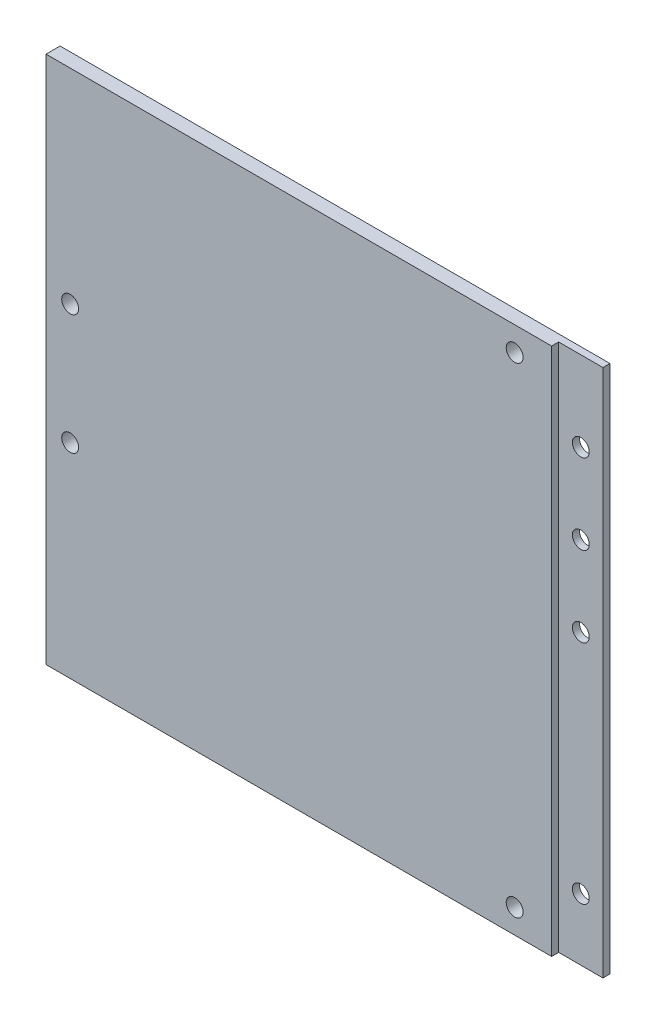
ISO-10303-21;
HEADER;
FILE_DESCRIPTION(('STEP AP214'),'2;1');
FILE_NAME('part.step','',(''),(''),'','','');
FILE_SCHEMA(('AUTOMOTIVE_DESIGN { 1 0 10303 214 1 1 1 1 }'));
ENDSEC;
DATA;
#1=APPLICATION_CONTEXT('core data for automotive mechanical design processes');
#2=APPLICATION_PROTOCOL_DEFINITION('international standard','automotive_design',2000,#1);
#3=PRODUCT_CONTEXT('',#1,'mechanical');
#4=PRODUCT('Part','Part','',(#3));
#5=PRODUCT_RELATED_PRODUCT_CATEGORY('part','',(#4));
#6=PRODUCT_DEFINITION_FORMATION('','',#4);
#7=PRODUCT_DEFINITION_CONTEXT('part definition',#1,'design');
#8=PRODUCT_DEFINITION('design','',#6,#7);
#9=PRODUCT_DEFINITION_SHAPE('','',#8);
#10=(LENGTH_UNIT() NAMED_UNIT(*) SI_UNIT(.MILLI.,.METRE.));
#11=(NAMED_UNIT(*) PLANE_ANGLE_UNIT() SI_UNIT($,.RADIAN.));
#12=(NAMED_UNIT(*) SI_UNIT($,.STERADIAN.) SOLID_ANGLE_UNIT());
#13=UNCERTAINTY_MEASURE_WITH_UNIT(LENGTH_MEASURE(1.E-05),#10,'distance_accuracy_value','');
#14=(GEOMETRIC_REPRESENTATION_CONTEXT(3) GLOBAL_UNCERTAINTY_ASSIGNED_CONTEXT((#13)) GLOBAL_UNIT_ASSIGNED_CONTEXT((#10,
#11,#12)) REPRESENTATION_CONTEXT('',''));
#15=CARTESIAN_POINT('',(0.,0.,0.));
#16=DIRECTION('',(0.,0.,1.));
#17=DIRECTION('',(1.,0.,0.));
#18=AXIS2_PLACEMENT_3D('',#15,#16,#17);
#19=CARTESIAN_POINT('',(0.,0.,3.175));
#20=DIRECTION('',(0.,0.,1.));
#21=DIRECTION('',(1.,0.,0.));
#22=AXIS2_PLACEMENT_3D('',#19,#20,#21);
#23=PLANE('',#22);
#24=CARTESIAN_POINT('',(84.5036557377049,-105.108390320062,3.175));
#25=DIRECTION('',(0.,0.,1.));
#26=DIRECTION('',(1.,0.,0.));
#27=AXIS2_PLACEMENT_3D('',#24,#25,#26);
#28=CIRCLE('',#27,1.90500000000001);
#29=CARTESIAN_POINT('',(86.4086557377049,-105.108390320062,3.175));
#30=VERTEX_POINT('',#29);
#31=EDGE_CURVE('E97',#30,#30,#28,.F.);
#32=ORIENTED_EDGE('',*,*,#31,.T.);
#33=EDGE_LOOP('',(#32));
#34=FACE_BOUND('',#33,.T.);
#35=CARTESIAN_POINT('',(84.5036557377049,3.36760967993755,3.175));
#36=DIRECTION('',(0.,0.,1.));
#37=DIRECTION('',(1.,0.,0.));
#38=AXIS2_PLACEMENT_3D('',#35,#36,#37);
#39=CIRCLE('',#38,1.90500000000001);
#40=CARTESIAN_POINT('',(86.4086557377049,3.36760967993755,3.175));
#41=VERTEX_POINT('',#40);
#42=EDGE_CURVE('E101',#41,#41,#39,.F.);
#43=ORIENTED_EDGE('',*,*,#42,.T.);
#44=EDGE_LOOP('',(#43));
#45=FACE_BOUND('',#44,.T.);
#46=CARTESIAN_POINT('',(-15.8673442622951,-64.4223903200624,3.175));
#47=DIRECTION('',(0.,0.,1.));
#48=DIRECTION('',(1.,0.,0.));
#49=AXIS2_PLACEMENT_3D('',#46,#47,#48);
#50=CIRCLE('',#49,1.905);
#51=CARTESIAN_POINT('',(-13.9623442622951,-64.4223903200624,3.175));
#52=VERTEX_POINT('',#51);
#53=EDGE_CURVE('E127',#52,#52,#50,.F.);
#54=ORIENTED_EDGE('',*,*,#53,.T.);
#55=EDGE_LOOP('',(#54));
#56=FACE_BOUND('',#55,.T.);
#57=CARTESIAN_POINT('',(-15.8673442622951,-37.3203903200625,3.175));
#58=DIRECTION('',(0.,0.,1.));
#59=DIRECTION('',(1.,0.,0.));
#60=AXIS2_PLACEMENT_3D('',#57,#58,#59);
#61=CIRCLE('',#60,1.905);
#62=CARTESIAN_POINT('',(-13.9623442622951,-37.3203903200625,3.175));
#63=VERTEX_POINT('',#62);
#64=EDGE_CURVE('E130',#63,#63,#61,.F.);
#65=ORIENTED_EDGE('',*,*,#64,.T.);
#66=EDGE_LOOP('',(#65));
#67=FACE_BOUND('',#66,.T.);
#68=DIRECTION('',(1.,0.,0.));
#69=VECTOR('',#68,1.);
#70=CARTESIAN_POINT('',(-21.3193442622951,-110.560390320062,3.175));
#71=LINE('',#70,#69);
#72=CARTESIAN_POINT('',(-21.3193442622951,-110.560390320062,3.175));
#73=VERTEX_POINT('',#72);
#74=CARTESIAN_POINT('',(92.8536557377049,-110.560390320062,3.17500006353088));
#75=VERTEX_POINT('',#74);
#76=EDGE_CURVE('E119',#73,#75,#71,.T.);
#77=ORIENTED_EDGE('',*,*,#76,.T.);
#78=DIRECTION('',(0.,-1.,0.));
#79=VECTOR('',#78,1.);
#80=CARTESIAN_POINT('',(92.8536557377049,8.81961037541127,3.17500006353089));
#81=LINE('',#80,#79);
#82=CARTESIAN_POINT('',(92.8536557377049,8.81960967993755,3.175));
#83=VERTEX_POINT('',#82);
#84=EDGE_CURVE('E151',#83,#75,#81,.T.);
#85=ORIENTED_EDGE('',*,*,#84,.F.);
#86=DIRECTION('',(-1.,0.,0.));
#87=VECTOR('',#86,1.);
#88=CARTESIAN_POINT('',(-21.3193442622951,8.81960967993755,3.175));
#89=LINE('',#88,#87);
#90=CARTESIAN_POINT('',(-21.3193442622951,8.81960967993755,3.175));
#91=VERTEX_POINT('',#90);
#92=EDGE_CURVE('E55',#83,#91,#89,.T.);
#93=ORIENTED_EDGE('',*,*,#92,.T.);
#94=DIRECTION('',(0.,-1.,0.));
#95=VECTOR('',#94,1.);
#96=CARTESIAN_POINT('',(-21.3193442622951,8.81960967993755,3.175));
#97=LINE('',#96,#95);
#98=EDGE_CURVE('E86',#91,#73,#97,.T.);
#99=ORIENTED_EDGE('',*,*,#98,.T.);
#100=EDGE_LOOP('',(#77,#85,#93,#99));
#101=FACE_BOUND('',#100,.T.);
#102=ADVANCED_FACE('F32',(#34,#45,#56,#67,#101),#23,.T.);
#103=CARTESIAN_POINT('',(-21.3193442622951,8.81960967993755,3.175));
#104=DIRECTION('',(1.,0.,0.));
#105=DIRECTION('',(0.,1.,0.));
#106=AXIS2_PLACEMENT_3D('',#103,#104,#105);
#107=PLANE('',#106);
#108=DIRECTION('',(0.,-1.,0.));
#109=VECTOR('',#108,1.);
#110=CARTESIAN_POINT('',(-21.3193442622951,8.81960967993755,0.));
#111=LINE('',#110,#109);
#112=CARTESIAN_POINT('',(-21.3193442622951,8.81960967993755,0.));
#113=VERTEX_POINT('',#112);
#114=CARTESIAN_POINT('',(-21.3193442622951,-110.560390320062,0.));
#115=VERTEX_POINT('',#114);
#116=EDGE_CURVE('E92',#113,#115,#111,.T.);
#117=ORIENTED_EDGE('',*,*,#116,.T.);
#118=DIRECTION('',(0.,0.,-1.));
#119=VECTOR('',#118,1.);
#120=CARTESIAN_POINT('',(-21.3193442622951,-110.560390320062,3.175));
#121=LINE('',#120,#119);
#122=EDGE_CURVE('E11',#73,#115,#121,.T.);
#123=ORIENTED_EDGE('',*,*,#122,.F.);
#124=ORIENTED_EDGE('',*,*,#98,.F.);
#125=DIRECTION('',(0.,0.,-1.));
#126=VECTOR('',#125,1.);
#127=CARTESIAN_POINT('',(-21.3193442622951,8.81960967993755,3.175));
#128=LINE('',#127,#126);
#129=EDGE_CURVE('E77',#91,#113,#128,.T.);
#130=ORIENTED_EDGE('',*,*,#129,.T.);
#131=EDGE_LOOP('',(#117,#123,#124,#130));
#132=FACE_BOUND('',#131,.T.);
#133=ADVANCED_FACE('F34',(#132),#107,.F.);
#134=CARTESIAN_POINT('',(-21.3193442622951,-110.560390320062,3.175));
#135=DIRECTION('',(0.,1.,0.));
#136=DIRECTION('',(0.,0.,1.));
#137=AXIS2_PLACEMENT_3D('',#134,#135,#136);
#138=PLANE('',#137);
#139=DIRECTION('',(0.,0.,-1.));
#140=VECTOR('',#139,1.);
#141=CARTESIAN_POINT('',(102.853655737705,-110.560390320062,3.175));
#142=LINE('',#141,#140);
#143=CARTESIAN_POINT('',(102.853655737705,-110.560390320062,1.58500006353088));
#144=VERTEX_POINT('',#143);
#145=CARTESIAN_POINT('',(102.853655737705,-110.560390320062,0.));
#146=VERTEX_POINT('',#145);
#147=EDGE_CURVE('E40',#144,#146,#142,.T.);
#148=ORIENTED_EDGE('',*,*,#147,.F.);
#149=DIRECTION('',(-1.,0.,0.));
#150=VECTOR('',#149,1.);
#151=CARTESIAN_POINT('',(-21.3193442622951,-110.560390320062,1.58500006353088));
#152=LINE('',#151,#150);
#153=CARTESIAN_POINT('',(92.8536557377049,-110.560390320062,1.58500006353088));
#154=VERTEX_POINT('',#153);
#155=EDGE_CURVE('E141',#144,#154,#152,.T.);
#156=ORIENTED_EDGE('',*,*,#155,.T.);
#157=DIRECTION('',(0.,0.,-1.));
#158=VECTOR('',#157,1.);
#159=CARTESIAN_POINT('',(92.8536557377049,-110.560390320062,3.175));
#160=LINE('',#159,#158);
#161=EDGE_CURVE('E122',#75,#154,#160,.T.);
#162=ORIENTED_EDGE('',*,*,#161,.F.);
#163=ORIENTED_EDGE('',*,*,#76,.F.);
#164=ORIENTED_EDGE('',*,*,#122,.T.);
#165=DIRECTION('',(1.,0.,0.));
#166=VECTOR('',#165,1.);
#167=CARTESIAN_POINT('',(-21.3193442622951,-110.560390320062,0.));
#168=LINE('',#167,#166);
#169=EDGE_CURVE('E96',#115,#146,#168,.T.);
#170=ORIENTED_EDGE('',*,*,#169,.T.);
#171=EDGE_LOOP('',(#148,#156,#162,#163,#164,#170));
#172=FACE_BOUND('',#171,.T.);
#173=ADVANCED_FACE('F116',(#172),#138,.F.);
#174=CARTESIAN_POINT('',(102.853655737705,8.81960967993755,3.175));
#175=DIRECTION('',(-1.,0.,0.));
#176=DIRECTION('',(0.,-1.,0.));
#177=AXIS2_PLACEMENT_3D('',#174,#175,#176);
#178=PLANE('',#177);
#179=DIRECTION('',(0.,0.,-1.));
#180=VECTOR('',#179,1.);
#181=CARTESIAN_POINT('',(102.853655737705,8.81960967993755,3.175));
#182=LINE('',#181,#180);
#183=CARTESIAN_POINT('',(102.853655737705,8.81961037541127,1.58500006353089));
#184=VERTEX_POINT('',#183);
#185=CARTESIAN_POINT('',(102.853655737705,8.81960967993755,0.));
#186=VERTEX_POINT('',#185);
#187=EDGE_CURVE('E81',#184,#186,#182,.T.);
#188=ORIENTED_EDGE('',*,*,#187,.F.);
#189=DIRECTION('',(0.,1.,0.));
#190=VECTOR('',#189,1.);
#191=CARTESIAN_POINT('',(102.853655737705,8.81961037541127,1.58500006353089));
#192=LINE('',#191,#190);
#193=EDGE_CURVE('E113',#144,#184,#192,.T.);
#194=ORIENTED_EDGE('',*,*,#193,.F.);
#195=ORIENTED_EDGE('',*,*,#147,.T.);
#196=DIRECTION('',(0.,1.,0.));
#197=VECTOR('',#196,1.);
#198=CARTESIAN_POINT('',(102.853655737705,8.81960967993755,0.));
#199=LINE('',#198,#197);
#200=EDGE_CURVE('E87',#146,#186,#199,.T.);
#201=ORIENTED_EDGE('',*,*,#200,.T.);
#202=EDGE_LOOP('',(#188,#194,#195,#201));
#203=FACE_BOUND('',#202,.T.);
#204=ADVANCED_FACE('F110',(#203),#178,.F.);
#205=CARTESIAN_POINT('',(-21.3193442622951,8.81960967993755,3.175));
#206=DIRECTION('',(0.,-1.,0.));
#207=DIRECTION('',(0.,0.,-1.));
#208=AXIS2_PLACEMENT_3D('',#205,#206,#207);
#209=PLANE('',#208);
#210=DIRECTION('',(0.,0.,1.));
#211=VECTOR('',#210,1.);
#212=CARTESIAN_POINT('',(92.8536557377049,8.81961037541127,3.17500006353089));
#213=LINE('',#212,#211);
#214=CARTESIAN_POINT('',(92.8536557377049,8.81961037541127,1.58500006353089));
#215=VERTEX_POINT('',#214);
#216=EDGE_CURVE('E47',#215,#83,#213,.T.);
#217=ORIENTED_EDGE('',*,*,#216,.F.);
#218=DIRECTION('',(1.,0.,0.));
#219=VECTOR('',#218,1.);
#220=CARTESIAN_POINT('',(92.8536557377049,8.81961037541127,1.58500006353089));
#221=LINE('',#220,#219);
#222=EDGE_CURVE('E148',#215,#184,#221,.T.);
#223=ORIENTED_EDGE('',*,*,#222,.T.);
#224=ORIENTED_EDGE('',*,*,#187,.T.);
#225=DIRECTION('',(-1.,0.,0.));
#226=VECTOR('',#225,1.);
#227=CARTESIAN_POINT('',(-21.3193442622951,8.81960967993755,0.));
#228=LINE('',#227,#226);
#229=EDGE_CURVE('E74',#186,#113,#228,.T.);
#230=ORIENTED_EDGE('',*,*,#229,.T.);
#231=ORIENTED_EDGE('',*,*,#129,.F.);
#232=ORIENTED_EDGE('',*,*,#92,.F.);
#233=EDGE_LOOP('',(#217,#223,#224,#230,#231,#232));
#234=FACE_BOUND('',#233,.T.);
#235=ADVANCED_FACE('F76',(#234),#209,.F.);
#236=CARTESIAN_POINT('',(0.,0.,0.));
#237=DIRECTION('',(0.,0.,1.));
#238=DIRECTION('',(1.,0.,0.));
#239=AXIS2_PLACEMENT_3D('',#236,#237,#238);
#240=PLANE('',#239);
#241=CARTESIAN_POINT('',(97.8536557377049,-9.26038962458872,0.));
#242=DIRECTION('',(0.,0.,1.));
#243=DIRECTION('',(1.,0.,0.));
#244=AXIS2_PLACEMENT_3D('',#241,#242,#243);
#245=CIRCLE('',#244,1.90500000000001);
#246=CARTESIAN_POINT('',(99.7586557377049,-9.26038962458872,0.));
#247=VERTEX_POINT('',#246);
#248=EDGE_CURVE('E152',#247,#247,#245,.T.);
#249=ORIENTED_EDGE('',*,*,#248,.T.);
#250=EDGE_LOOP('',(#249));
#251=FACE_BOUND('',#250,.T.);
#252=CARTESIAN_POINT('',(97.8536557377049,-27.3503896245887,0.));
#253=DIRECTION('',(0.,0.,1.));
#254=DIRECTION('',(1.,0.,0.));
#255=AXIS2_PLACEMENT_3D('',#252,#253,#254);
#256=CIRCLE('',#255,1.90500000000001);
#257=CARTESIAN_POINT('',(99.7586557377049,-27.3503896245887,0.));
#258=VERTEX_POINT('',#257);
#259=EDGE_CURVE('E159',#258,#258,#256,.T.);
#260=ORIENTED_EDGE('',*,*,#259,.T.);
#261=EDGE_LOOP('',(#260));
#262=FACE_BOUND('',#261,.T.);
#263=CARTESIAN_POINT('',(97.853655737705,-45.4303896245887,0.));
#264=DIRECTION('',(0.,0.,1.));
#265=DIRECTION('',(1.,0.,0.));
#266=AXIS2_PLACEMENT_3D('',#263,#264,#265);
#267=CIRCLE('',#266,1.90500000000001);
#268=CARTESIAN_POINT('',(99.758655737705,-45.4303896245887,0.));
#269=VERTEX_POINT('',#268);
#270=EDGE_CURVE('E162',#269,#269,#267,.T.);
#271=ORIENTED_EDGE('',*,*,#270,.T.);
#272=EDGE_LOOP('',(#271));
#273=FACE_BOUND('',#272,.T.);
#274=CARTESIAN_POINT('',(97.8536557377049,-96.5603903200625,0.));
#275=DIRECTION('',(0.,0.,1.));
#276=DIRECTION('',(1.,0.,0.));
#277=AXIS2_PLACEMENT_3D('',#274,#275,#276);
#278=CIRCLE('',#277,1.90500000000001);
#279=CARTESIAN_POINT('',(99.7586557377049,-96.5603903200625,0.));
#280=VERTEX_POINT('',#279);
#281=EDGE_CURVE('E165',#280,#280,#278,.T.);
#282=ORIENTED_EDGE('',*,*,#281,.T.);
#283=EDGE_LOOP('',(#282));
#284=FACE_BOUND('',#283,.T.);
#285=CARTESIAN_POINT('',(84.5036557377049,-105.108390320062,0.));
#286=DIRECTION('',(0.,0.,1.));
#287=DIRECTION('',(1.,0.,0.));
#288=AXIS2_PLACEMENT_3D('',#285,#286,#287);
#289=CIRCLE('',#288,1.90500000000001);
#290=CARTESIAN_POINT('',(86.4086557377049,-105.108390320062,0.));
#291=VERTEX_POINT('',#290);
#292=EDGE_CURVE('E137',#291,#291,#289,.T.);
#293=ORIENTED_EDGE('',*,*,#292,.T.);
#294=EDGE_LOOP('',(#293));
#295=FACE_BOUND('',#294,.T.);
#296=CARTESIAN_POINT('',(84.5036557377049,3.36760967993755,0.));
#297=DIRECTION('',(0.,0.,1.));
#298=DIRECTION('',(1.,0.,0.));
#299=AXIS2_PLACEMENT_3D('',#296,#297,#298);
#300=CIRCLE('',#299,1.90500000000001);
#301=CARTESIAN_POINT('',(86.4086557377049,3.36760967993755,0.));
#302=VERTEX_POINT('',#301);
#303=EDGE_CURVE('E140',#302,#302,#300,.T.);
#304=ORIENTED_EDGE('',*,*,#303,.T.);
#305=EDGE_LOOP('',(#304));
#306=FACE_BOUND('',#305,.T.);
#307=CARTESIAN_POINT('',(-15.8673442622951,-64.4223903200624,0.));
#308=DIRECTION('',(0.,0.,1.));
#309=DIRECTION('',(1.,0.,0.));
#310=AXIS2_PLACEMENT_3D('',#307,#308,#309);
#311=CIRCLE('',#310,1.905);
#312=CARTESIAN_POINT('',(-13.9623442622951,-64.4223903200624,0.));
#313=VERTEX_POINT('',#312);
#314=EDGE_CURVE('E136',#313,#313,#311,.T.);
#315=ORIENTED_EDGE('',*,*,#314,.T.);
#316=EDGE_LOOP('',(#315));
#317=FACE_BOUND('',#316,.T.);
#318=CARTESIAN_POINT('',(-15.8673442622951,-37.3203903200625,0.));
#319=DIRECTION('',(0.,0.,1.));
#320=DIRECTION('',(1.,0.,0.));
#321=AXIS2_PLACEMENT_3D('',#318,#319,#320);
#322=CIRCLE('',#321,1.905);
#323=CARTESIAN_POINT('',(-13.9623442622951,-37.3203903200625,0.));
#324=VERTEX_POINT('',#323);
#325=EDGE_CURVE('E133',#324,#324,#322,.T.);
#326=ORIENTED_EDGE('',*,*,#325,.T.);
#327=EDGE_LOOP('',(#326));
#328=FACE_BOUND('',#327,.T.);
#329=ORIENTED_EDGE('',*,*,#116,.F.);
#330=ORIENTED_EDGE('',*,*,#229,.F.);
#331=ORIENTED_EDGE('',*,*,#200,.F.);
#332=ORIENTED_EDGE('',*,*,#169,.F.);
#333=EDGE_LOOP('',(#329,#330,#331,#332));
#334=FACE_BOUND('',#333,.T.);
#335=ADVANCED_FACE('F94',(#251,#262,#273,#284,#295,#306,#317,#328,#334),#240,.F.);
#336=CARTESIAN_POINT('',(-15.8673442622951,-37.3203903200625,14.175));
#337=DIRECTION('',(0.,0.,-1.));
#338=DIRECTION('',(-1.,0.,0.));
#339=AXIS2_PLACEMENT_3D('',#336,#337,#338);
#340=CYLINDRICAL_SURFACE('',#339,1.905);
#341=ORIENTED_EDGE('',*,*,#64,.F.);
#342=EDGE_LOOP('',(#341));
#343=FACE_BOUND('',#342,.T.);
#344=ORIENTED_EDGE('',*,*,#325,.F.);
#345=EDGE_LOOP('',(#344));
#346=FACE_BOUND('',#345,.T.);
#347=ADVANCED_FACE('F223',(#343,#346),#340,.F.);
#348=CARTESIAN_POINT('',(-15.8673442622951,-64.4223903200624,14.175));
#349=DIRECTION('',(0.,0.,-1.));
#350=DIRECTION('',(-1.,0.,0.));
#351=AXIS2_PLACEMENT_3D('',#348,#349,#350);
#352=CYLINDRICAL_SURFACE('',#351,1.905);
#353=ORIENTED_EDGE('',*,*,#53,.F.);
#354=EDGE_LOOP('',(#353));
#355=FACE_BOUND('',#354,.T.);
#356=ORIENTED_EDGE('',*,*,#314,.F.);
#357=EDGE_LOOP('',(#356));
#358=FACE_BOUND('',#357,.T.);
#359=ADVANCED_FACE('F255',(#355,#358),#352,.F.);
#360=CARTESIAN_POINT('',(84.5036557377049,3.36760967993755,14.175));
#361=DIRECTION('',(0.,0.,-1.));
#362=DIRECTION('',(-1.,0.,0.));
#363=AXIS2_PLACEMENT_3D('',#360,#361,#362);
#364=CYLINDRICAL_SURFACE('',#363,1.90500000000001);
#365=ORIENTED_EDGE('',*,*,#42,.F.);
#366=EDGE_LOOP('',(#365));
#367=FACE_BOUND('',#366,.T.);
#368=ORIENTED_EDGE('',*,*,#303,.F.);
#369=EDGE_LOOP('',(#368));
#370=FACE_BOUND('',#369,.T.);
#371=ADVANCED_FACE('F262',(#367,#370),#364,.F.);
#372=CARTESIAN_POINT('',(84.5036557377049,-105.108390320062,14.175));
#373=DIRECTION('',(0.,0.,-1.));
#374=DIRECTION('',(-1.,0.,0.));
#375=AXIS2_PLACEMENT_3D('',#372,#373,#374);
#376=CYLINDRICAL_SURFACE('',#375,1.90500000000001);
#377=ORIENTED_EDGE('',*,*,#31,.F.);
#378=EDGE_LOOP('',(#377));
#379=FACE_BOUND('',#378,.T.);
#380=ORIENTED_EDGE('',*,*,#292,.F.);
#381=EDGE_LOOP('',(#380));
#382=FACE_BOUND('',#381,.T.);
#383=ADVANCED_FACE('F188',(#379,#382),#376,.F.);
#384=CARTESIAN_POINT('',(92.8536557377049,8.81961037541127,1.58500006353089));
#385=DIRECTION('',(0.,0.,-1.));
#386=DIRECTION('',(0.,1.,0.));
#387=AXIS2_PLACEMENT_3D('',#384,#385,#386);
#388=PLANE('',#387);
#389=CARTESIAN_POINT('',(97.8536557377049,-9.26038962458872,1.58500006353089));
#390=DIRECTION('',(0.,0.,1.));
#391=DIRECTION('',(1.,0.,0.));
#392=AXIS2_PLACEMENT_3D('',#389,#390,#391);
#393=CIRCLE('',#392,1.90500000000001);
#394=CARTESIAN_POINT('',(99.7586557377049,-9.26038962458872,1.58500006353089));
#395=VERTEX_POINT('',#394);
#396=EDGE_CURVE('E168',#395,#395,#393,.T.);
#397=ORIENTED_EDGE('',*,*,#396,.F.);
#398=EDGE_LOOP('',(#397));
#399=FACE_BOUND('',#398,.T.);
#400=CARTESIAN_POINT('',(97.8536557377049,-27.3503896245887,1.58500006353089));
#401=DIRECTION('',(0.,0.,1.));
#402=DIRECTION('',(1.,0.,0.));
#403=AXIS2_PLACEMENT_3D('',#400,#401,#402);
#404=CIRCLE('',#403,1.90500000000001);
#405=CARTESIAN_POINT('',(99.7586557377049,-27.3503896245887,1.58500006353089));
#406=VERTEX_POINT('',#405);
#407=EDGE_CURVE('E175',#406,#406,#404,.T.);
#408=ORIENTED_EDGE('',*,*,#407,.F.);
#409=EDGE_LOOP('',(#408));
#410=FACE_BOUND('',#409,.T.);
#411=CARTESIAN_POINT('',(97.853655737705,-45.4303896245887,1.58500006353089));
#412=DIRECTION('',(0.,0.,1.));
#413=DIRECTION('',(1.,0.,0.));
#414=AXIS2_PLACEMENT_3D('',#411,#412,#413);
#415=CIRCLE('',#414,1.90500000000001);
#416=CARTESIAN_POINT('',(99.758655737705,-45.4303896245887,1.58500006353089));
#417=VERTEX_POINT('',#416);
#418=EDGE_CURVE('E172',#417,#417,#415,.T.);
#419=ORIENTED_EDGE('',*,*,#418,.F.);
#420=EDGE_LOOP('',(#419));
#421=FACE_BOUND('',#420,.T.);
#422=CARTESIAN_POINT('',(97.8536557377049,-96.5603903200625,1.58500006353089));
#423=DIRECTION('',(0.,0.,1.));
#424=DIRECTION('',(1.,0.,0.));
#425=AXIS2_PLACEMENT_3D('',#422,#423,#424);
#426=CIRCLE('',#425,1.90500000000001);
#427=CARTESIAN_POINT('',(99.7586557377049,-96.5603903200625,1.58500006353089));
#428=VERTEX_POINT('',#427);
#429=EDGE_CURVE('E169',#428,#428,#426,.T.);
#430=ORIENTED_EDGE('',*,*,#429,.F.);
#431=EDGE_LOOP('',(#430));
#432=FACE_BOUND('',#431,.T.);
#433=ORIENTED_EDGE('',*,*,#193,.T.);
#434=ORIENTED_EDGE('',*,*,#222,.F.);
#435=DIRECTION('',(0.,1.,0.));
#436=VECTOR('',#435,1.);
#437=CARTESIAN_POINT('',(92.8536557377049,8.81961037541127,1.58500006353089));
#438=LINE('',#437,#436);
#439=EDGE_CURVE('E154',#154,#215,#438,.T.);
#440=ORIENTED_EDGE('',*,*,#439,.F.);
#441=ORIENTED_EDGE('',*,*,#155,.F.);
#442=EDGE_LOOP('',(#433,#434,#440,#441));
#443=FACE_BOUND('',#442,.T.);
#444=ADVANCED_FACE('F184',(#399,#410,#421,#432,#443),#388,.F.);
#445=CARTESIAN_POINT('',(92.8536557377049,0.,0.));
#446=DIRECTION('',(1.,0.,0.));
#447=DIRECTION('',(0.,1.,0.));
#448=AXIS2_PLACEMENT_3D('',#445,#446,#447);
#449=PLANE('',#448);
#450=ORIENTED_EDGE('',*,*,#161,.T.);
#451=ORIENTED_EDGE('',*,*,#439,.T.);
#452=ORIENTED_EDGE('',*,*,#216,.T.);
#453=ORIENTED_EDGE('',*,*,#84,.T.);
#454=EDGE_LOOP('',(#450,#451,#452,#453));
#455=FACE_BOUND('',#454,.T.);
#456=ADVANCED_FACE('F187',(#455),#449,.T.);
#457=CARTESIAN_POINT('',(97.8536557377049,-96.5603903200625,-8.41499993646911));
#458=DIRECTION('',(0.,0.,1.));
#459=DIRECTION('',(1.,0.,0.));
#460=AXIS2_PLACEMENT_3D('',#457,#458,#459);
#461=CYLINDRICAL_SURFACE('',#460,1.90500000000001);
#462=ORIENTED_EDGE('',*,*,#429,.T.);
#463=EDGE_LOOP('',(#462));
#464=FACE_BOUND('',#463,.T.);
#465=ORIENTED_EDGE('',*,*,#281,.F.);
#466=EDGE_LOOP('',(#465));
#467=FACE_BOUND('',#466,.T.);
#468=ADVANCED_FACE('F206',(#464,#467),#461,.F.);
#469=CARTESIAN_POINT('',(97.853655737705,-45.4303896245887,-8.41499993646911));
#470=DIRECTION('',(0.,0.,1.));
#471=DIRECTION('',(1.,0.,0.));
#472=AXIS2_PLACEMENT_3D('',#469,#470,#471);
#473=CYLINDRICAL_SURFACE('',#472,1.90500000000001);
#474=ORIENTED_EDGE('',*,*,#418,.T.);
#475=EDGE_LOOP('',(#474));
#476=FACE_BOUND('',#475,.T.);
#477=ORIENTED_EDGE('',*,*,#270,.F.);
#478=EDGE_LOOP('',(#477));
#479=FACE_BOUND('',#478,.T.);
#480=ADVANCED_FACE('F211',(#476,#479),#473,.F.);
#481=CARTESIAN_POINT('',(97.8536557377049,-27.3503896245887,-8.41499993646911));
#482=DIRECTION('',(0.,0.,1.));
#483=DIRECTION('',(1.,0.,0.));
#484=AXIS2_PLACEMENT_3D('',#481,#482,#483);
#485=CYLINDRICAL_SURFACE('',#484,1.90500000000001);
#486=ORIENTED_EDGE('',*,*,#407,.T.);
#487=EDGE_LOOP('',(#486));
#488=FACE_BOUND('',#487,.T.);
#489=ORIENTED_EDGE('',*,*,#259,.F.);
#490=EDGE_LOOP('',(#489));
#491=FACE_BOUND('',#490,.T.);
#492=ADVANCED_FACE('F297',(#488,#491),#485,.F.);
#493=CARTESIAN_POINT('',(97.8536557377049,-9.26038962458872,-8.41499993646911));
#494=DIRECTION('',(0.,0.,1.));
#495=DIRECTION('',(1.,0.,0.));
#496=AXIS2_PLACEMENT_3D('',#493,#494,#495);
#497=CYLINDRICAL_SURFACE('',#496,1.90500000000001);
#498=ORIENTED_EDGE('',*,*,#396,.T.);
#499=EDGE_LOOP('',(#498));
#500=FACE_BOUND('',#499,.T.);
#501=ORIENTED_EDGE('',*,*,#248,.F.);
#502=EDGE_LOOP('',(#501));
#503=FACE_BOUND('',#502,.T.);
#504=ADVANCED_FACE('F181',(#500,#503),#497,.F.);
#505=CLOSED_SHELL('',(#102,#133,#173,#204,#235,#335,#347,#359,#371,#383,#444,#456,#468,#480,
#492,#504));
#506=MANIFOLD_SOLID_BREP('B2',#505);
#507=ADVANCED_BREP_SHAPE_REPRESENTATION('',(#18,#506),#14);
#508=SHAPE_DEFINITION_REPRESENTATION(#9,#507);
ENDSEC;
END-ISO-10303-21;
